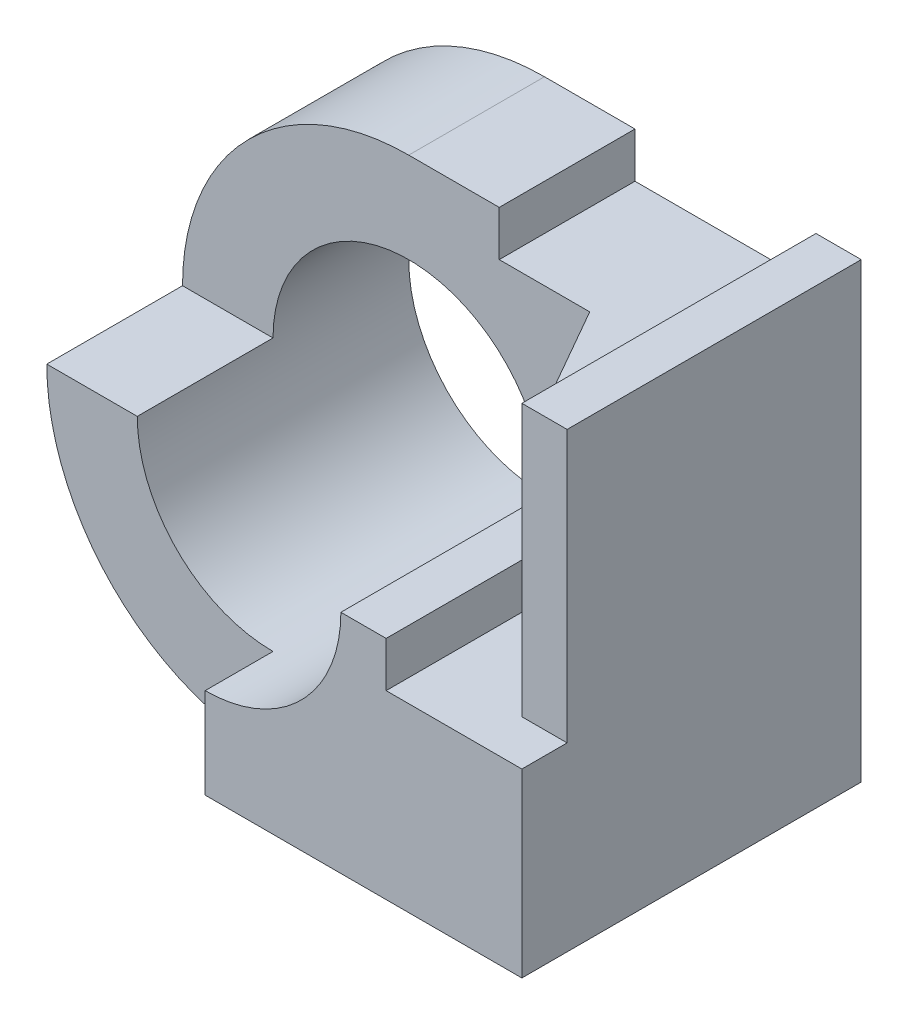
ISO-10303-21;
HEADER;
FILE_DESCRIPTION(('STEP AP214'),'2;1');
FILE_NAME('part.step','',(''),(''),'','','');
FILE_SCHEMA(('AUTOMOTIVE_DESIGN { 1 0 10303 214 1 1 1 1 }'));
ENDSEC;
DATA;
#1=APPLICATION_CONTEXT('core data for automotive mechanical design processes');
#2=APPLICATION_PROTOCOL_DEFINITION('international standard','automotive_design',2000,#1);
#3=PRODUCT_CONTEXT('',#1,'mechanical');
#4=PRODUCT('Part','Part','',(#3));
#5=PRODUCT_RELATED_PRODUCT_CATEGORY('part','',(#4));
#6=PRODUCT_DEFINITION_FORMATION('','',#4);
#7=PRODUCT_DEFINITION_CONTEXT('part definition',#1,'design');
#8=PRODUCT_DEFINITION('design','',#6,#7);
#9=PRODUCT_DEFINITION_SHAPE('','',#8);
#10=(LENGTH_UNIT() NAMED_UNIT(*) SI_UNIT(.MILLI.,.METRE.));
#11=(NAMED_UNIT(*) PLANE_ANGLE_UNIT() SI_UNIT($,.RADIAN.));
#12=(NAMED_UNIT(*) SI_UNIT($,.STERADIAN.) SOLID_ANGLE_UNIT());
#13=UNCERTAINTY_MEASURE_WITH_UNIT(LENGTH_MEASURE(1.E-05),#10,'distance_accuracy_value','');
#14=(GEOMETRIC_REPRESENTATION_CONTEXT(3) GLOBAL_UNCERTAINTY_ASSIGNED_CONTEXT((#13)) GLOBAL_UNIT_ASSIGNED_CONTEXT((#10,
#11,#12)) REPRESENTATION_CONTEXT('',''));
#15=CARTESIAN_POINT('',(0.,0.,0.));
#16=DIRECTION('',(0.,0.,1.));
#17=DIRECTION('',(1.,0.,0.));
#18=AXIS2_PLACEMENT_3D('',#15,#16,#17);
#19=CARTESIAN_POINT('',(-3.5,0.,7.5));
#20=DIRECTION('',(0.,0.,-1.));
#21=DIRECTION('',(-1.,0.,0.));
#22=AXIS2_PLACEMENT_3D('',#19,#20,#21);
#23=CYLINDRICAL_SURFACE('',#22,5.);
#24=CARTESIAN_POINT('',(-3.5,0.,6.));
#25=DIRECTION('',(0.,0.,1.));
#26=DIRECTION('',(1.,0.,0.));
#27=AXIS2_PLACEMENT_3D('',#24,#25,#26);
#28=CIRCLE('',#27,5.);
#29=CARTESIAN_POINT('',(-8.5,0.,6.));
#30=VERTEX_POINT('',#29);
#31=CARTESIAN_POINT('',(-3.49999999999995,-5.,6.));
#32=VERTEX_POINT('',#31);
#33=EDGE_CURVE('E197',#30,#32,#28,.T.);
#34=ORIENTED_EDGE('',*,*,#33,.F.);
#35=DIRECTION('',(0.,0.,1.));
#36=VECTOR('',#35,1.);
#37=CARTESIAN_POINT('',(-8.5,0.,3.));
#38=LINE('',#37,#36);
#39=CARTESIAN_POINT('',(-8.5,0.,3.));
#40=VERTEX_POINT('',#39);
#41=EDGE_CURVE('E210',#40,#30,#38,.T.);
#42=ORIENTED_EDGE('',*,*,#41,.F.);
#43=CARTESIAN_POINT('',(-3.5,0.,3.));
#44=DIRECTION('',(0.,0.,-1.));
#45=DIRECTION('',(-1.,0.,0.));
#46=AXIS2_PLACEMENT_3D('',#43,#44,#45);
#47=CIRCLE('',#46,5.);
#48=CARTESIAN_POINT('',(-3.5,5.,3.));
#49=VERTEX_POINT('',#48);
#50=EDGE_CURVE('E226',#40,#49,#47,.T.);
#51=ORIENTED_EDGE('',*,*,#50,.T.);
#52=DIRECTION('',(0.,0.,-1.));
#53=VECTOR('',#52,1.);
#54=CARTESIAN_POINT('',(-3.5,5.,7.5));
#55=LINE('',#54,#53);
#56=CARTESIAN_POINT('',(-3.5,5.,0.));
#57=VERTEX_POINT('',#56);
#58=EDGE_CURVE('E236',#49,#57,#55,.T.);
#59=ORIENTED_EDGE('',*,*,#58,.T.);
#60=CARTESIAN_POINT('',(-3.5,0.,0.));
#61=DIRECTION('',(0.,0.,1.));
#62=DIRECTION('',(1.,0.,0.));
#63=AXIS2_PLACEMENT_3D('',#60,#61,#62);
#64=CIRCLE('',#63,5.);
#65=CARTESIAN_POINT('',(-3.5,-5.,0.));
#66=VERTEX_POINT('',#65);
#67=EDGE_CURVE('E239',#57,#66,#64,.T.);
#68=ORIENTED_EDGE('',*,*,#67,.T.);
#69=DIRECTION('',(0.,0.,-1.));
#70=VECTOR('',#69,1.);
#71=CARTESIAN_POINT('',(-3.5,-5.,7.5));
#72=LINE('',#71,#70);
#73=EDGE_CURVE('E271',#32,#66,#72,.T.);
#74=ORIENTED_EDGE('',*,*,#73,.F.);
#75=EDGE_LOOP('',(#34,#42,#51,#59,#68,#74));
#76=FACE_BOUND('',#75,.T.);
#77=ADVANCED_FACE('F35',(#76),#23,.T.);
#78=CARTESIAN_POINT('',(-8.5,0.,3.));
#79=DIRECTION('',(0.,-1.,0.));
#80=DIRECTION('',(1.,0.,0.));
#81=AXIS2_PLACEMENT_3D('',#78,#79,#80);
#82=PLANE('',#81);
#83=DIRECTION('',(-1.,0.,0.));
#84=VECTOR('',#83,1.);
#85=CARTESIAN_POINT('',(-8.5,0.,6.));
#86=LINE('',#85,#84);
#87=CARTESIAN_POINT('',(-6.5,0.,6.));
#88=VERTEX_POINT('',#87);
#89=EDGE_CURVE('E11',#88,#30,#86,.T.);
#90=ORIENTED_EDGE('',*,*,#89,.F.);
#91=DIRECTION('',(0.,0.,-1.));
#92=VECTOR('',#91,1.);
#93=CARTESIAN_POINT('',(-6.5,0.,7.5));
#94=LINE('',#93,#92);
#95=CARTESIAN_POINT('',(-6.5,0.,3.));
#96=VERTEX_POINT('',#95);
#97=EDGE_CURVE('E217',#88,#96,#94,.T.);
#98=ORIENTED_EDGE('',*,*,#97,.T.);
#99=DIRECTION('',(1.,0.,0.));
#100=VECTOR('',#99,1.);
#101=CARTESIAN_POINT('',(-8.5,0.,3.));
#102=LINE('',#101,#100);
#103=EDGE_CURVE('E202',#40,#96,#102,.T.);
#104=ORIENTED_EDGE('',*,*,#103,.F.);
#105=ORIENTED_EDGE('',*,*,#41,.T.);
#106=EDGE_LOOP('',(#90,#98,#104,#105));
#107=FACE_BOUND('',#106,.T.);
#108=ADVANCED_FACE('F307',(#107),#82,.F.);
#109=CARTESIAN_POINT('',(0.,-5.,7.5));
#110=DIRECTION('',(0.,1.,0.));
#111=DIRECTION('',(0.,0.,1.));
#112=AXIS2_PLACEMENT_3D('',#109,#110,#111);
#113=PLANE('',#112);
#114=DIRECTION('',(1.,0.,0.));
#115=VECTOR('',#114,1.);
#116=CARTESIAN_POINT('',(0.,-5.,0.));
#117=LINE('',#116,#115);
#118=CARTESIAN_POINT('',(3.5,-5.,0.));
#119=VERTEX_POINT('',#118);
#120=EDGE_CURVE('E242',#66,#119,#117,.T.);
#121=ORIENTED_EDGE('',*,*,#120,.T.);
#122=DIRECTION('',(0.,0.,-1.));
#123=VECTOR('',#122,1.);
#124=CARTESIAN_POINT('',(3.5,-5.,7.5));
#125=LINE('',#124,#123);
#126=CARTESIAN_POINT('',(3.5,-5.,7.5));
#127=VERTEX_POINT('',#126);
#128=EDGE_CURVE('E268',#127,#119,#125,.T.);
#129=ORIENTED_EDGE('',*,*,#128,.F.);
#130=DIRECTION('',(1.,0.,0.));
#131=VECTOR('',#130,1.);
#132=CARTESIAN_POINT('',(0.,-5.,7.5));
#133=LINE('',#132,#131);
#134=CARTESIAN_POINT('',(-3.49999999999995,-5.,7.5));
#135=VERTEX_POINT('',#134);
#136=EDGE_CURVE('E231',#135,#127,#133,.T.);
#137=ORIENTED_EDGE('',*,*,#136,.F.);
#138=EDGE_CURVE('E272',#135,#32,#72,.T.);
#139=ORIENTED_EDGE('',*,*,#138,.T.);
#140=ORIENTED_EDGE('',*,*,#73,.T.);
#141=EDGE_LOOP('',(#121,#129,#137,#139,#140));
#142=FACE_BOUND('',#141,.T.);
#143=ADVANCED_FACE('F312',(#142),#113,.F.);
#144=CARTESIAN_POINT('',(3.5,0.,7.5));
#145=DIRECTION('',(-1.,0.,0.));
#146=DIRECTION('',(0.,0.,1.));
#147=AXIS2_PLACEMENT_3D('',#144,#145,#146);
#148=PLANE('',#147);
#149=DIRECTION('',(0.,0.,-1.));
#150=VECTOR('',#149,1.);
#151=CARTESIAN_POINT('',(3.5,5.,7.5));
#152=LINE('',#151,#150);
#153=CARTESIAN_POINT('',(3.5,5.,6.5));
#154=VERTEX_POINT('',#153);
#155=CARTESIAN_POINT('',(3.5,5.,0.));
#156=VERTEX_POINT('',#155);
#157=EDGE_CURVE('E179',#154,#156,#152,.T.);
#158=ORIENTED_EDGE('',*,*,#157,.F.);
#159=DIRECTION('',(0.,1.,0.));
#160=VECTOR('',#159,1.);
#161=CARTESIAN_POINT('',(3.5,-1.,6.5));
#162=LINE('',#161,#160);
#163=CARTESIAN_POINT('',(3.5,-1.,6.5));
#164=VERTEX_POINT('',#163);
#165=EDGE_CURVE('E156',#164,#154,#162,.T.);
#166=ORIENTED_EDGE('',*,*,#165,.F.);
#167=DIRECTION('',(0.,0.,-1.));
#168=VECTOR('',#167,1.);
#169=CARTESIAN_POINT('',(3.5,-1.,7.5));
#170=LINE('',#169,#168);
#171=CARTESIAN_POINT('',(3.5,-1.,7.5));
#172=VERTEX_POINT('',#171);
#173=EDGE_CURVE('E164',#172,#164,#170,.T.);
#174=ORIENTED_EDGE('',*,*,#173,.F.);
#175=DIRECTION('',(0.,1.,0.));
#176=VECTOR('',#175,1.);
#177=CARTESIAN_POINT('',(3.5,0.,7.5));
#178=LINE('',#177,#176);
#179=EDGE_CURVE('E234',#127,#172,#178,.T.);
#180=ORIENTED_EDGE('',*,*,#179,.F.);
#181=ORIENTED_EDGE('',*,*,#128,.T.);
#182=DIRECTION('',(0.,1.,0.));
#183=VECTOR('',#182,1.);
#184=CARTESIAN_POINT('',(3.5,0.,0.));
#185=LINE('',#184,#183);
#186=EDGE_CURVE('E244',#119,#156,#185,.T.);
#187=ORIENTED_EDGE('',*,*,#186,.T.);
#188=EDGE_LOOP('',(#158,#166,#174,#180,#181,#187));
#189=FACE_BOUND('',#188,.T.);
#190=ADVANCED_FACE('F177',(#189),#148,.F.);
#191=CARTESIAN_POINT('',(0.,5.,7.5));
#192=DIRECTION('',(0.,1.,0.));
#193=DIRECTION('',(0.,0.,1.));
#194=AXIS2_PLACEMENT_3D('',#191,#192,#193);
#195=PLANE('',#194);
#196=DIRECTION('',(-1.,0.,0.));
#197=VECTOR('',#196,1.);
#198=CARTESIAN_POINT('',(3.5,5.,6.5));
#199=LINE('',#198,#197);
#200=CARTESIAN_POINT('',(2.5,5.,6.5));
#201=VERTEX_POINT('',#200);
#202=EDGE_CURVE('E174',#154,#201,#199,.T.);
#203=ORIENTED_EDGE('',*,*,#202,.F.);
#204=ORIENTED_EDGE('',*,*,#157,.T.);
#205=DIRECTION('',(1.,0.,0.));
#206=VECTOR('',#205,1.);
#207=CARTESIAN_POINT('',(0.,5.,0.));
#208=LINE('',#207,#206);
#209=CARTESIAN_POINT('',(2.5,5.,0.));
#210=VERTEX_POINT('',#209);
#211=EDGE_CURVE('E246',#210,#156,#208,.T.);
#212=ORIENTED_EDGE('',*,*,#211,.F.);
#213=DIRECTION('',(0.,0.,-1.));
#214=VECTOR('',#213,1.);
#215=CARTESIAN_POINT('',(2.5,5.,7.5));
#216=LINE('',#215,#214);
#217=EDGE_CURVE('E265',#201,#210,#216,.T.);
#218=ORIENTED_EDGE('',*,*,#217,.F.);
#219=EDGE_LOOP('',(#203,#204,#212,#218));
#220=FACE_BOUND('',#219,.T.);
#221=ADVANCED_FACE('F322',(#220),#195,.T.);
#222=CARTESIAN_POINT('',(2.5,0.,7.5));
#223=DIRECTION('',(1.,0.,0.));
#224=DIRECTION('',(0.,1.,0.));
#225=AXIS2_PLACEMENT_3D('',#222,#223,#224);
#226=PLANE('',#225);
#227=DIRECTION('',(0.,0.,-1.));
#228=VECTOR('',#227,1.);
#229=CARTESIAN_POINT('',(2.5,4.,7.5));
#230=LINE('',#229,#228);
#231=CARTESIAN_POINT('',(2.5,4.,6.5));
#232=VERTEX_POINT('',#231);
#233=CARTESIAN_POINT('',(2.5,4.,0.));
#234=VERTEX_POINT('',#233);
#235=EDGE_CURVE('E263',#232,#234,#230,.T.);
#236=ORIENTED_EDGE('',*,*,#235,.F.);
#237=DIRECTION('',(0.,1.,0.));
#238=VECTOR('',#237,1.);
#239=CARTESIAN_POINT('',(2.5,-1.,6.5));
#240=LINE('',#239,#238);
#241=EDGE_CURVE('E180',#232,#201,#240,.T.);
#242=ORIENTED_EDGE('',*,*,#241,.T.);
#243=ORIENTED_EDGE('',*,*,#217,.T.);
#244=DIRECTION('',(0.,-1.,0.));
#245=VECTOR('',#244,1.);
#246=CARTESIAN_POINT('',(2.5,0.,0.));
#247=LINE('',#246,#245);
#248=EDGE_CURVE('E249',#210,#234,#247,.T.);
#249=ORIENTED_EDGE('',*,*,#248,.T.);
#250=EDGE_LOOP('',(#236,#242,#243,#249));
#251=FACE_BOUND('',#250,.T.);
#252=ADVANCED_FACE('F323',(#251),#226,.F.);
#253=CARTESIAN_POINT('',(0.,4.,7.5));
#254=DIRECTION('',(0.,-1.,0.));
#255=DIRECTION('',(0.,0.,-1.));
#256=AXIS2_PLACEMENT_3D('',#253,#254,#255);
#257=PLANE('',#256);
#258=DIRECTION('',(1.,0.,0.));
#259=VECTOR('',#258,1.);
#260=CARTESIAN_POINT('',(0.,4.,3.));
#261=LINE('',#260,#259);
#262=CARTESIAN_POINT('',(-1.5,4.,3.));
#263=VERTEX_POINT('',#262);
#264=CARTESIAN_POINT('',(0.499999999999999,4.,3.));
#265=VERTEX_POINT('',#264);
#266=EDGE_CURVE('E223',#263,#265,#261,.T.);
#267=ORIENTED_EDGE('',*,*,#266,.T.);
#268=DIRECTION('',(0.496138938356834,0.,0.868243142124459));
#269=VECTOR('',#268,1.);
#270=CARTESIAN_POINT('',(2.31538461538462,4.,6.17692307692308));
#271=LINE('',#270,#269);
#272=EDGE_CURVE('E188',#265,#232,#271,.T.);
#273=ORIENTED_EDGE('',*,*,#272,.T.);
#274=ORIENTED_EDGE('',*,*,#235,.T.);
#275=DIRECTION('',(-1.,0.,0.));
#276=VECTOR('',#275,1.);
#277=CARTESIAN_POINT('',(0.,4.,0.));
#278=LINE('',#277,#276);
#279=CARTESIAN_POINT('',(-1.5,4.,0.));
#280=VERTEX_POINT('',#279);
#281=EDGE_CURVE('E252',#234,#280,#278,.T.);
#282=ORIENTED_EDGE('',*,*,#281,.T.);
#283=DIRECTION('',(0.,0.,-1.));
#284=VECTOR('',#283,1.);
#285=CARTESIAN_POINT('',(-1.5,4.,7.5));
#286=LINE('',#285,#284);
#287=EDGE_CURVE('E261',#263,#280,#286,.T.);
#288=ORIENTED_EDGE('',*,*,#287,.F.);
#289=EDGE_LOOP('',(#267,#273,#274,#282,#288));
#290=FACE_BOUND('',#289,.T.);
#291=ADVANCED_FACE('F326',(#290),#257,.F.);
#292=CARTESIAN_POINT('',(-1.5,0.,7.5));
#293=DIRECTION('',(1.,0.,0.));
#294=DIRECTION('',(0.,1.,0.));
#295=AXIS2_PLACEMENT_3D('',#292,#293,#294);
#296=PLANE('',#295);
#297=DIRECTION('',(0.,1.,0.));
#298=VECTOR('',#297,1.);
#299=CARTESIAN_POINT('',(-1.5,0.,3.));
#300=LINE('',#299,#298);
#301=CARTESIAN_POINT('',(-1.5,5.,3.));
#302=VERTEX_POINT('',#301);
#303=EDGE_CURVE('E221',#263,#302,#300,.T.);
#304=ORIENTED_EDGE('',*,*,#303,.F.);
#305=ORIENTED_EDGE('',*,*,#287,.T.);
#306=DIRECTION('',(0.,-1.,0.));
#307=VECTOR('',#306,1.);
#308=CARTESIAN_POINT('',(-1.5,0.,0.));
#309=LINE('',#308,#307);
#310=CARTESIAN_POINT('',(-1.5,5.,0.));
#311=VERTEX_POINT('',#310);
#312=EDGE_CURVE('E255',#311,#280,#309,.T.);
#313=ORIENTED_EDGE('',*,*,#312,.F.);
#314=DIRECTION('',(0.,0.,-1.));
#315=VECTOR('',#314,1.);
#316=CARTESIAN_POINT('',(-1.5,5.,7.5));
#317=LINE('',#316,#315);
#318=EDGE_CURVE('E259',#302,#311,#317,.T.);
#319=ORIENTED_EDGE('',*,*,#318,.F.);
#320=EDGE_LOOP('',(#304,#305,#313,#319));
#321=FACE_BOUND('',#320,.T.);
#322=ADVANCED_FACE('F330',(#321),#296,.T.);
#323=CARTESIAN_POINT('',(-3.5,0.,7.5));
#324=DIRECTION('',(0.,0.,-1.));
#325=DIRECTION('',(-1.,0.,0.));
#326=AXIS2_PLACEMENT_3D('',#323,#324,#325);
#327=CYLINDRICAL_SURFACE('',#326,3.);
#328=DIRECTION('',(0.,0.,-1.));
#329=VECTOR('',#328,1.);
#330=CARTESIAN_POINT('',(-3.49999999999995,-3.,7.5));
#331=LINE('',#330,#329);
#332=CARTESIAN_POINT('',(-3.49999999999995,-3.,7.5));
#333=VERTEX_POINT('',#332);
#334=CARTESIAN_POINT('',(-3.49999999999995,-3.,6.));
#335=VERTEX_POINT('',#334);
#336=EDGE_CURVE('E199',#333,#335,#331,.T.);
#337=ORIENTED_EDGE('',*,*,#336,.F.);
#338=CARTESIAN_POINT('',(-3.5,0.,7.5));
#339=DIRECTION('',(0.,0.,1.));
#340=DIRECTION('',(1.,0.,0.));
#341=AXIS2_PLACEMENT_3D('',#338,#339,#340);
#342=CIRCLE('',#341,3.);
#343=CARTESIAN_POINT('',(-0.499999999999999,0.,7.5));
#344=VERTEX_POINT('',#343);
#345=EDGE_CURVE('E57',#333,#344,#342,.T.);
#346=ORIENTED_EDGE('',*,*,#345,.T.);
#347=DIRECTION('',(0.,0.,-1.));
#348=VECTOR('',#347,1.);
#349=CARTESIAN_POINT('',(-0.499999999999999,0.,7.5));
#350=LINE('',#349,#348);
#351=CARTESIAN_POINT('',(-0.499999999999999,0.,3.));
#352=VERTEX_POINT('',#351);
#353=EDGE_CURVE('E213',#352,#344,#350,.F.);
#354=ORIENTED_EDGE('',*,*,#353,.F.);
#355=CARTESIAN_POINT('',(-3.5,0.,3.));
#356=DIRECTION('',(0.,0.,-1.));
#357=DIRECTION('',(-1.,0.,0.));
#358=AXIS2_PLACEMENT_3D('',#355,#356,#357);
#359=CIRCLE('',#358,3.);
#360=EDGE_CURVE('E219',#96,#352,#359,.T.);
#361=ORIENTED_EDGE('',*,*,#360,.F.);
#362=ORIENTED_EDGE('',*,*,#97,.F.);
#363=CARTESIAN_POINT('',(-3.5,0.,6.));
#364=DIRECTION('',(0.,0.,1.));
#365=DIRECTION('',(1.,0.,0.));
#366=AXIS2_PLACEMENT_3D('',#363,#364,#365);
#367=CIRCLE('',#366,3.);
#368=EDGE_CURVE('E49',#88,#335,#367,.T.);
#369=ORIENTED_EDGE('',*,*,#368,.T.);
#370=EDGE_LOOP('',(#337,#346,#354,#361,#362,#369));
#371=FACE_BOUND('',#370,.T.);
#372=CARTESIAN_POINT('',(-3.5,0.,0.));
#373=DIRECTION('',(0.,0.,1.));
#374=DIRECTION('',(1.,0.,0.));
#375=AXIS2_PLACEMENT_3D('',#372,#373,#374);
#376=CIRCLE('',#375,3.);
#377=CARTESIAN_POINT('',(-0.499999999999999,0.,0.));
#378=VERTEX_POINT('',#377);
#379=EDGE_CURVE('E229',#378,#378,#376,.T.);
#380=ORIENTED_EDGE('',*,*,#379,.F.);
#381=EDGE_LOOP('',(#380));
#382=FACE_BOUND('',#381,.T.);
#383=ADVANCED_FACE('F37',(#371,#382),#327,.F.);
#384=DIRECTION('',(-1.,0.,0.));
#385=VECTOR('',#384,1.);
#386=CARTESIAN_POINT('',(-8.5,5.,3.));
#387=LINE('',#386,#385);
#388=EDGE_CURVE('E208',#302,#49,#387,.T.);
#389=ORIENTED_EDGE('',*,*,#388,.F.);
#390=ORIENTED_EDGE('',*,*,#318,.T.);
#391=EDGE_CURVE('E232',#57,#311,#208,.T.);
#392=ORIENTED_EDGE('',*,*,#391,.F.);
#393=ORIENTED_EDGE('',*,*,#58,.F.);
#394=EDGE_LOOP('',(#389,#390,#392,#393));
#395=FACE_BOUND('',#394,.T.);
#396=ADVANCED_FACE('F335',(#395),#195,.T.);
#397=CARTESIAN_POINT('',(0.,0.,7.5));
#398=DIRECTION('',(0.,0.,1.));
#399=DIRECTION('',(1.,0.,0.));
#400=AXIS2_PLACEMENT_3D('',#397,#398,#399);
#401=PLANE('',#400);
#402=DIRECTION('',(0.,1.,0.));
#403=VECTOR('',#402,1.);
#404=CARTESIAN_POINT('',(0.499999999999999,-1.,7.5));
#405=LINE('',#404,#403);
#406=CARTESIAN_POINT('',(0.499999999999999,-1.,7.5));
#407=VERTEX_POINT('',#406);
#408=CARTESIAN_POINT('',(0.499999999999999,0.,7.5));
#409=VERTEX_POINT('',#408);
#410=EDGE_CURVE('E192',#407,#409,#405,.T.);
#411=ORIENTED_EDGE('',*,*,#410,.T.);
#412=DIRECTION('',(1.,0.,0.));
#413=VECTOR('',#412,1.);
#414=CARTESIAN_POINT('',(0.,0.,7.5));
#415=LINE('',#414,#413);
#416=EDGE_CURVE('E43',#344,#409,#415,.T.);
#417=ORIENTED_EDGE('',*,*,#416,.F.);
#418=ORIENTED_EDGE('',*,*,#345,.F.);
#419=DIRECTION('',(0.,1.,0.));
#420=VECTOR('',#419,1.);
#421=CARTESIAN_POINT('',(-3.49999999999995,0.,7.5));
#422=LINE('',#421,#420);
#423=EDGE_CURVE('E191',#135,#333,#422,.T.);
#424=ORIENTED_EDGE('',*,*,#423,.F.);
#425=ORIENTED_EDGE('',*,*,#136,.T.);
#426=ORIENTED_EDGE('',*,*,#179,.T.);
#427=DIRECTION('',(1.,0.,0.));
#428=VECTOR('',#427,1.);
#429=CARTESIAN_POINT('',(0.499999999999999,-1.,7.5));
#430=LINE('',#429,#428);
#431=EDGE_CURVE('E170',#407,#172,#430,.T.);
#432=ORIENTED_EDGE('',*,*,#431,.F.);
#433=EDGE_LOOP('',(#411,#417,#418,#424,#425,#426,#432));
#434=FACE_BOUND('',#433,.T.);
#435=ADVANCED_FACE('F282',(#434),#401,.T.);
#436=CARTESIAN_POINT('',(0.,0.,0.));
#437=DIRECTION('',(0.,0.,1.));
#438=DIRECTION('',(1.,0.,0.));
#439=AXIS2_PLACEMENT_3D('',#436,#437,#438);
#440=PLANE('',#439);
#441=ORIENTED_EDGE('',*,*,#379,.T.);
#442=EDGE_LOOP('',(#441));
#443=FACE_BOUND('',#442,.T.);
#444=ORIENTED_EDGE('',*,*,#67,.F.);
#445=ORIENTED_EDGE('',*,*,#391,.T.);
#446=ORIENTED_EDGE('',*,*,#312,.T.);
#447=ORIENTED_EDGE('',*,*,#281,.F.);
#448=ORIENTED_EDGE('',*,*,#248,.F.);
#449=ORIENTED_EDGE('',*,*,#211,.T.);
#450=ORIENTED_EDGE('',*,*,#186,.F.);
#451=ORIENTED_EDGE('',*,*,#120,.F.);
#452=EDGE_LOOP('',(#444,#445,#446,#447,#448,#449,#450,#451));
#453=FACE_BOUND('',#452,.T.);
#454=ADVANCED_FACE('F339',(#443,#453),#440,.F.);
#455=CARTESIAN_POINT('',(0.,0.,3.));
#456=DIRECTION('',(0.,0.,-1.));
#457=DIRECTION('',(-1.,0.,0.));
#458=AXIS2_PLACEMENT_3D('',#455,#456,#457);
#459=PLANE('',#458);
#460=ORIENTED_EDGE('',*,*,#103,.T.);
#461=ORIENTED_EDGE('',*,*,#360,.T.);
#462=CARTESIAN_POINT('',(0.499999999999999,0.,3.));
#463=VERTEX_POINT('',#462);
#464=EDGE_CURVE('E201',#352,#463,#102,.T.);
#465=ORIENTED_EDGE('',*,*,#464,.T.);
#466=DIRECTION('',(0.,1.,0.));
#467=VECTOR('',#466,1.);
#468=CARTESIAN_POINT('',(0.499999999999999,0.,3.));
#469=LINE('',#468,#467);
#470=EDGE_CURVE('E205',#463,#265,#469,.T.);
#471=ORIENTED_EDGE('',*,*,#470,.T.);
#472=ORIENTED_EDGE('',*,*,#266,.F.);
#473=ORIENTED_EDGE('',*,*,#303,.T.);
#474=ORIENTED_EDGE('',*,*,#388,.T.);
#475=ORIENTED_EDGE('',*,*,#50,.F.);
#476=EDGE_LOOP('',(#460,#461,#465,#471,#472,#473,#474,#475));
#477=FACE_BOUND('',#476,.T.);
#478=ADVANCED_FACE('F342',(#477),#459,.F.);
#479=ORIENTED_EDGE('',*,*,#353,.T.);
#480=ORIENTED_EDGE('',*,*,#416,.T.);
#481=DIRECTION('',(0.,0.,1.));
#482=VECTOR('',#481,1.);
#483=CARTESIAN_POINT('',(0.499999999999999,0.,3.));
#484=LINE('',#483,#482);
#485=EDGE_CURVE('E211',#463,#409,#484,.T.);
#486=ORIENTED_EDGE('',*,*,#485,.F.);
#487=ORIENTED_EDGE('',*,*,#464,.F.);
#488=EDGE_LOOP('',(#479,#480,#486,#487));
#489=FACE_BOUND('',#488,.T.);
#490=ADVANCED_FACE('F278',(#489),#82,.F.);
#491=CARTESIAN_POINT('',(0.,0.,6.));
#492=DIRECTION('',(0.,0.,1.));
#493=DIRECTION('',(1.,0.,0.));
#494=AXIS2_PLACEMENT_3D('',#491,#492,#493);
#495=PLANE('',#494);
#496=ORIENTED_EDGE('',*,*,#33,.T.);
#497=DIRECTION('',(0.,1.,0.));
#498=VECTOR('',#497,1.);
#499=CARTESIAN_POINT('',(-3.49999999999995,0.,6.));
#500=LINE('',#499,#498);
#501=EDGE_CURVE('E193',#32,#335,#500,.T.);
#502=ORIENTED_EDGE('',*,*,#501,.T.);
#503=ORIENTED_EDGE('',*,*,#368,.F.);
#504=ORIENTED_EDGE('',*,*,#89,.T.);
#505=EDGE_LOOP('',(#496,#502,#503,#504));
#506=FACE_BOUND('',#505,.T.);
#507=ADVANCED_FACE('F347',(#506),#495,.T.);
#508=CARTESIAN_POINT('',(-3.49999999999995,0.,6.));
#509=DIRECTION('',(1.,0.,0.));
#510=DIRECTION('',(0.,0.,-1.));
#511=AXIS2_PLACEMENT_3D('',#508,#509,#510);
#512=PLANE('',#511);
#513=ORIENTED_EDGE('',*,*,#336,.T.);
#514=ORIENTED_EDGE('',*,*,#501,.F.);
#515=ORIENTED_EDGE('',*,*,#138,.F.);
#516=ORIENTED_EDGE('',*,*,#423,.T.);
#517=EDGE_LOOP('',(#513,#514,#515,#516));
#518=FACE_BOUND('',#517,.T.);
#519=ADVANCED_FACE('F303',(#518),#512,.F.);
#520=CARTESIAN_POINT('',(2.5,-1.,6.5));
#521=DIRECTION('',(0.868243142124459,0.,-0.496138938356834));
#522=DIRECTION('',(-0.496138938356834,0.,-0.868243142124459));
#523=AXIS2_PLACEMENT_3D('',#520,#521,#522);
#524=PLANE('',#523);
#525=ORIENTED_EDGE('',*,*,#470,.F.);
#526=DIRECTION('',(0.,1.,0.));
#527=VECTOR('',#526,1.);
#528=CARTESIAN_POINT('',(0.499999999999999,-1.,3.));
#529=LINE('',#528,#527);
#530=CARTESIAN_POINT('',(0.499999999999999,-1.,3.));
#531=VERTEX_POINT('',#530);
#532=EDGE_CURVE('E286',#531,#463,#529,.T.);
#533=ORIENTED_EDGE('',*,*,#532,.F.);
#534=DIRECTION('',(-0.496138938356834,0.,-0.868243142124459));
#535=VECTOR('',#534,1.);
#536=CARTESIAN_POINT('',(2.5,-1.,6.5));
#537=LINE('',#536,#535);
#538=CARTESIAN_POINT('',(2.5,-1.,6.5));
#539=VERTEX_POINT('',#538);
#540=EDGE_CURVE('E163',#539,#531,#537,.T.);
#541=ORIENTED_EDGE('',*,*,#540,.F.);
#542=EDGE_CURVE('E159',#539,#232,#240,.T.);
#543=ORIENTED_EDGE('',*,*,#542,.T.);
#544=ORIENTED_EDGE('',*,*,#272,.F.);
#545=EDGE_LOOP('',(#525,#533,#541,#543,#544));
#546=FACE_BOUND('',#545,.T.);
#547=ADVANCED_FACE('F293',(#546),#524,.F.);
#548=CARTESIAN_POINT('',(0.499999999999999,-1.,3.));
#549=DIRECTION('',(-1.,0.,0.));
#550=DIRECTION('',(0.,0.,1.));
#551=AXIS2_PLACEMENT_3D('',#548,#549,#550);
#552=PLANE('',#551);
#553=ORIENTED_EDGE('',*,*,#410,.F.);
#554=DIRECTION('',(0.,0.,1.));
#555=VECTOR('',#554,1.);
#556=CARTESIAN_POINT('',(0.499999999999999,-1.,3.));
#557=LINE('',#556,#555);
#558=EDGE_CURVE('E184',#531,#407,#557,.T.);
#559=ORIENTED_EDGE('',*,*,#558,.F.);
#560=ORIENTED_EDGE('',*,*,#532,.T.);
#561=ORIENTED_EDGE('',*,*,#485,.T.);
#562=EDGE_LOOP('',(#553,#559,#560,#561));
#563=FACE_BOUND('',#562,.T.);
#564=ADVANCED_FACE('F295',(#563),#552,.F.);
#565=CARTESIAN_POINT('',(3.5,-1.,6.5));
#566=DIRECTION('',(0.,0.,-1.));
#567=DIRECTION('',(-1.,0.,0.));
#568=AXIS2_PLACEMENT_3D('',#565,#566,#567);
#569=PLANE('',#568);
#570=ORIENTED_EDGE('',*,*,#202,.T.);
#571=ORIENTED_EDGE('',*,*,#241,.F.);
#572=ORIENTED_EDGE('',*,*,#542,.F.);
#573=DIRECTION('',(-1.,0.,0.));
#574=VECTOR('',#573,1.);
#575=CARTESIAN_POINT('',(3.5,-1.,6.5));
#576=LINE('',#575,#574);
#577=EDGE_CURVE('E152',#164,#539,#576,.T.);
#578=ORIENTED_EDGE('',*,*,#577,.F.);
#579=ORIENTED_EDGE('',*,*,#165,.T.);
#580=EDGE_LOOP('',(#570,#571,#572,#578,#579));
#581=FACE_BOUND('',#580,.T.);
#582=ADVANCED_FACE('F154',(#581),#569,.F.);
#583=CARTESIAN_POINT('',(0.,-1.,0.));
#584=DIRECTION('',(0.,1.,0.));
#585=DIRECTION('',(0.,0.,1.));
#586=AXIS2_PLACEMENT_3D('',#583,#584,#585);
#587=PLANE('',#586);
#588=ORIENTED_EDGE('',*,*,#173,.T.);
#589=ORIENTED_EDGE('',*,*,#577,.T.);
#590=ORIENTED_EDGE('',*,*,#540,.T.);
#591=ORIENTED_EDGE('',*,*,#558,.T.);
#592=ORIENTED_EDGE('',*,*,#431,.T.);
#593=EDGE_LOOP('',(#588,#589,#590,#591,#592));
#594=FACE_BOUND('',#593,.T.);
#595=ADVANCED_FACE('F167',(#594),#587,.T.);
#596=CLOSED_SHELL('',(#77,#108,#143,#190,#221,#252,#291,#322,#383,#396,#435,#454,#478,#490,#507,
#519,#547,#564,#582,#595));
#597=MANIFOLD_SOLID_BREP('B2',#596);
#598=ADVANCED_BREP_SHAPE_REPRESENTATION('',(#18,#597),#14);
#599=SHAPE_DEFINITION_REPRESENTATION(#9,#598);
ENDSEC;
END-ISO-10303-21;
